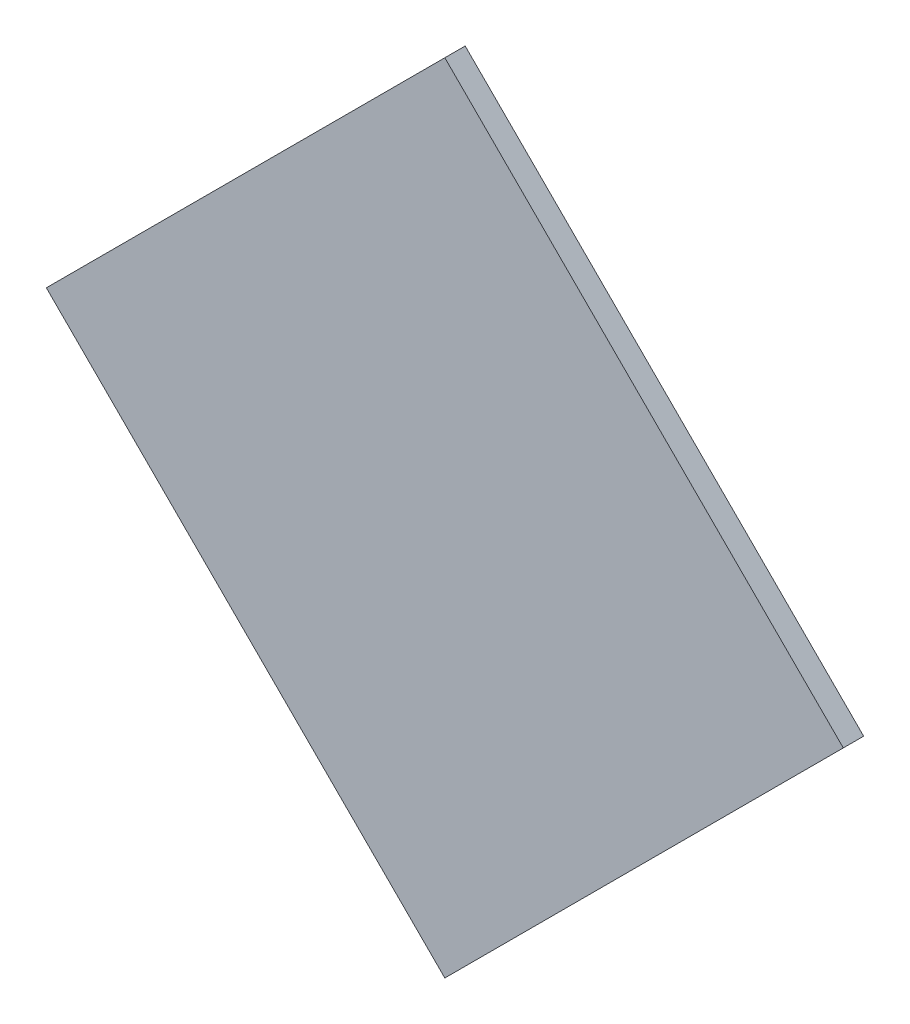
ISO-10303-21;
HEADER;
FILE_DESCRIPTION(('STEP AP214'),'2;1');
FILE_NAME('part.step','',(''),(''),'','','');
FILE_SCHEMA(('AUTOMOTIVE_DESIGN { 1 0 10303 214 1 1 1 1 }'));
ENDSEC;
DATA;
#1=APPLICATION_CONTEXT('core data for automotive mechanical design processes');
#2=APPLICATION_PROTOCOL_DEFINITION('international standard','automotive_design',2000,#1);
#3=PRODUCT_CONTEXT('',#1,'mechanical');
#4=PRODUCT('Part','Part','',(#3));
#5=PRODUCT_RELATED_PRODUCT_CATEGORY('part','',(#4));
#6=PRODUCT_DEFINITION_FORMATION('','',#4);
#7=PRODUCT_DEFINITION_CONTEXT('part definition',#1,'design');
#8=PRODUCT_DEFINITION('design','',#6,#7);
#9=PRODUCT_DEFINITION_SHAPE('','',#8);
#10=(LENGTH_UNIT() NAMED_UNIT(*) SI_UNIT(.MILLI.,.METRE.));
#11=(NAMED_UNIT(*) PLANE_ANGLE_UNIT() SI_UNIT($,.RADIAN.));
#12=(NAMED_UNIT(*) SI_UNIT($,.STERADIAN.) SOLID_ANGLE_UNIT());
#13=UNCERTAINTY_MEASURE_WITH_UNIT(LENGTH_MEASURE(1.E-05),#10,'distance_accuracy_value','');
#14=(GEOMETRIC_REPRESENTATION_CONTEXT(3) GLOBAL_UNCERTAINTY_ASSIGNED_CONTEXT((#13)) GLOBAL_UNIT_ASSIGNED_CONTEXT((#10,
#11,#12)) REPRESENTATION_CONTEXT('',''));
#15=CARTESIAN_POINT('',(0.,0.,0.));
#16=DIRECTION('',(0.,0.,1.));
#17=DIRECTION('',(1.,0.,0.));
#18=AXIS2_PLACEMENT_3D('',#15,#16,#17);
#19=CARTESIAN_POINT('',(4.309398,4.089398,0.76487));
#20=DIRECTION('',(0.,0.,-1.));
#21=DIRECTION('',(-1.,0.,0.));
#22=AXIS2_PLACEMENT_3D('',#19,#20,#21);
#23=PLANE('',#22);
#24=DIRECTION('',(0.707106781186548,0.707106781186548,0.));
#25=VECTOR('',#24,1.);
#26=CARTESIAN_POINT('',(3.637646667,4.089398,0.76487));
#27=LINE('',#26,#25);
#28=CARTESIAN_POINT('',(3.637646667,4.089398,0.76487));
#29=VERTEX_POINT('',#28);
#30=CARTESIAN_POINT('',(4.309398,4.761149333,0.76487));
#31=VERTEX_POINT('',#30);
#32=EDGE_CURVE('E55',#29,#31,#27,.T.);
#33=ORIENTED_EDGE('',*,*,#32,.T.);
#34=DIRECTION('',(0.707106781186548,-0.707106781186548,0.));
#35=VECTOR('',#34,1.);
#36=CARTESIAN_POINT('',(4.309398,4.761149333,0.76487));
#37=LINE('',#36,#35);
#38=CARTESIAN_POINT('',(4.981149333,4.089398,0.76487));
#39=VERTEX_POINT('',#38);
#40=EDGE_CURVE('E57',#31,#39,#37,.T.);
#41=ORIENTED_EDGE('',*,*,#40,.T.);
#42=DIRECTION('',(-0.707106781186548,-0.707106781186548,0.));
#43=VECTOR('',#42,1.);
#44=CARTESIAN_POINT('',(4.981149333,4.089398,0.76487));
#45=LINE('',#44,#43);
#46=CARTESIAN_POINT('',(4.309398,3.417646667,0.76487));
#47=VERTEX_POINT('',#46);
#48=EDGE_CURVE('E20',#39,#47,#45,.T.);
#49=ORIENTED_EDGE('',*,*,#48,.T.);
#50=DIRECTION('',(-0.707106781186548,0.707106781186548,0.));
#51=VECTOR('',#50,1.);
#52=CARTESIAN_POINT('',(4.309398,3.417646667,0.76487));
#53=LINE('',#52,#51);
#54=EDGE_CURVE('E80',#47,#29,#53,.T.);
#55=ORIENTED_EDGE('',*,*,#54,.T.);
#56=EDGE_LOOP('',(#33,#41,#49,#55));
#57=FACE_BOUND('',#56,.T.);
#58=ADVANCED_FACE('F17',(#57),#23,.T.);
#59=CARTESIAN_POINT('',(4.981149333,4.089398,0.76487));
#60=DIRECTION('',(-0.707106781186548,0.707106781186548,0.));
#61=DIRECTION('',(-0.707106781186548,-0.707106781186548,0.));
#62=AXIS2_PLACEMENT_3D('',#59,#60,#61);
#63=PLANE('',#62);
#64=DIRECTION('',(0.,0.,1.));
#65=VECTOR('',#64,1.);
#66=CARTESIAN_POINT('',(4.309398,3.417646667,0.76487));
#67=LINE('',#66,#65);
#68=CARTESIAN_POINT('',(4.309398,3.417646667,0.79916));
#69=VERTEX_POINT('',#68);
#70=EDGE_CURVE('E68',#69,#47,#67,.F.);
#71=ORIENTED_EDGE('',*,*,#70,.T.);
#72=ORIENTED_EDGE('',*,*,#48,.F.);
#73=DIRECTION('',(0.,0.,1.));
#74=VECTOR('',#73,1.);
#75=CARTESIAN_POINT('',(4.981149333,4.089398,0.76487));
#76=LINE('',#75,#74);
#77=CARTESIAN_POINT('',(4.981149333,4.089398,0.79916));
#78=VERTEX_POINT('',#77);
#79=EDGE_CURVE('E63',#39,#78,#76,.T.);
#80=ORIENTED_EDGE('',*,*,#79,.T.);
#81=DIRECTION('',(0.707106781186548,0.707106781186547,0.));
#82=VECTOR('',#81,1.);
#83=CARTESIAN_POINT('',(4.309398,3.417646667,0.79916));
#84=LINE('',#83,#82);
#85=EDGE_CURVE('E83',#69,#78,#84,.T.);
#86=ORIENTED_EDGE('',*,*,#85,.F.);
#87=EDGE_LOOP('',(#71,#72,#80,#86));
#88=FACE_BOUND('',#87,.T.);
#89=ADVANCED_FACE('F65',(#88),#63,.F.);
#90=CARTESIAN_POINT('',(4.309398,4.761149333,0.76487));
#91=DIRECTION('',(-0.707106781186548,-0.707106781186548,0.));
#92=DIRECTION('',(0.707106781186548,-0.707106781186548,0.));
#93=AXIS2_PLACEMENT_3D('',#90,#91,#92);
#94=PLANE('',#93);
#95=ORIENTED_EDGE('',*,*,#79,.F.);
#96=ORIENTED_EDGE('',*,*,#40,.F.);
#97=DIRECTION('',(0.,0.,1.));
#98=VECTOR('',#97,1.);
#99=CARTESIAN_POINT('',(4.309398,4.761149333,0.76487));
#100=LINE('',#99,#98);
#101=CARTESIAN_POINT('',(4.309398,4.761149333,0.79916));
#102=VERTEX_POINT('',#101);
#103=EDGE_CURVE('E75',#31,#102,#100,.T.);
#104=ORIENTED_EDGE('',*,*,#103,.T.);
#105=DIRECTION('',(-0.707106781186548,0.707106781186547,0.));
#106=VECTOR('',#105,1.);
#107=CARTESIAN_POINT('',(4.981149333,4.089398,0.79916));
#108=LINE('',#107,#106);
#109=EDGE_CURVE('E72',#78,#102,#108,.T.);
#110=ORIENTED_EDGE('',*,*,#109,.F.);
#111=EDGE_LOOP('',(#95,#96,#104,#110));
#112=FACE_BOUND('',#111,.T.);
#113=ADVANCED_FACE('F70',(#112),#94,.F.);
#114=CARTESIAN_POINT('',(3.637646667,4.089398,0.76487));
#115=DIRECTION('',(0.707106781186548,-0.707106781186548,0.));
#116=DIRECTION('',(0.707106781186548,0.707106781186548,0.));
#117=AXIS2_PLACEMENT_3D('',#114,#115,#116);
#118=PLANE('',#117);
#119=ORIENTED_EDGE('',*,*,#103,.F.);
#120=ORIENTED_EDGE('',*,*,#32,.F.);
#121=DIRECTION('',(0.,0.,1.));
#122=VECTOR('',#121,1.);
#123=CARTESIAN_POINT('',(3.637646667,4.089398,0.76487));
#124=LINE('',#123,#122);
#125=CARTESIAN_POINT('',(3.637646667,4.089398,0.79916));
#126=VERTEX_POINT('',#125);
#127=EDGE_CURVE('E35',#29,#126,#124,.T.);
#128=ORIENTED_EDGE('',*,*,#127,.T.);
#129=DIRECTION('',(-0.707106781186548,-0.707106781186548,0.));
#130=VECTOR('',#129,1.);
#131=CARTESIAN_POINT('',(4.309398,4.761149333,0.79916));
#132=LINE('',#131,#130);
#133=EDGE_CURVE('E26',#102,#126,#132,.T.);
#134=ORIENTED_EDGE('',*,*,#133,.F.);
#135=EDGE_LOOP('',(#119,#120,#128,#134));
#136=FACE_BOUND('',#135,.T.);
#137=ADVANCED_FACE('F89',(#136),#118,.F.);
#138=CARTESIAN_POINT('',(4.309398,3.417646667,0.76487));
#139=DIRECTION('',(0.707106781186548,0.707106781186548,0.));
#140=DIRECTION('',(-0.707106781186548,0.707106781186548,0.));
#141=AXIS2_PLACEMENT_3D('',#138,#139,#140);
#142=PLANE('',#141);
#143=ORIENTED_EDGE('',*,*,#127,.F.);
#144=ORIENTED_EDGE('',*,*,#54,.F.);
#145=ORIENTED_EDGE('',*,*,#70,.F.);
#146=DIRECTION('',(0.707106781186548,-0.707106781186548,0.));
#147=VECTOR('',#146,1.);
#148=CARTESIAN_POINT('',(3.637646667,4.089398,0.79916));
#149=LINE('',#148,#147);
#150=EDGE_CURVE('E11',#126,#69,#149,.T.);
#151=ORIENTED_EDGE('',*,*,#150,.F.);
#152=EDGE_LOOP('',(#143,#144,#145,#151));
#153=FACE_BOUND('',#152,.T.);
#154=ADVANCED_FACE('F91',(#153),#142,.F.);
#155=CARTESIAN_POINT('',(4.309398,4.089398,0.79916));
#156=DIRECTION('',(0.,0.,1.));
#157=DIRECTION('',(0.,-1.,0.));
#158=AXIS2_PLACEMENT_3D('',#155,#156,#157);
#159=PLANE('',#158);
#160=ORIENTED_EDGE('',*,*,#133,.T.);
#161=ORIENTED_EDGE('',*,*,#150,.T.);
#162=ORIENTED_EDGE('',*,*,#85,.T.);
#163=ORIENTED_EDGE('',*,*,#109,.T.);
#164=EDGE_LOOP('',(#160,#161,#162,#163));
#165=FACE_BOUND('',#164,.T.);
#166=ADVANCED_FACE('F88',(#165),#159,.T.);
#167=CLOSED_SHELL('',(#58,#89,#113,#137,#154,#166));
#168=MANIFOLD_SOLID_BREP('B1',#167);
#169=ADVANCED_BREP_SHAPE_REPRESENTATION('',(#18,#168),#14);
#170=SHAPE_DEFINITION_REPRESENTATION(#9,#169);
ENDSEC;
END-ISO-10303-21;
